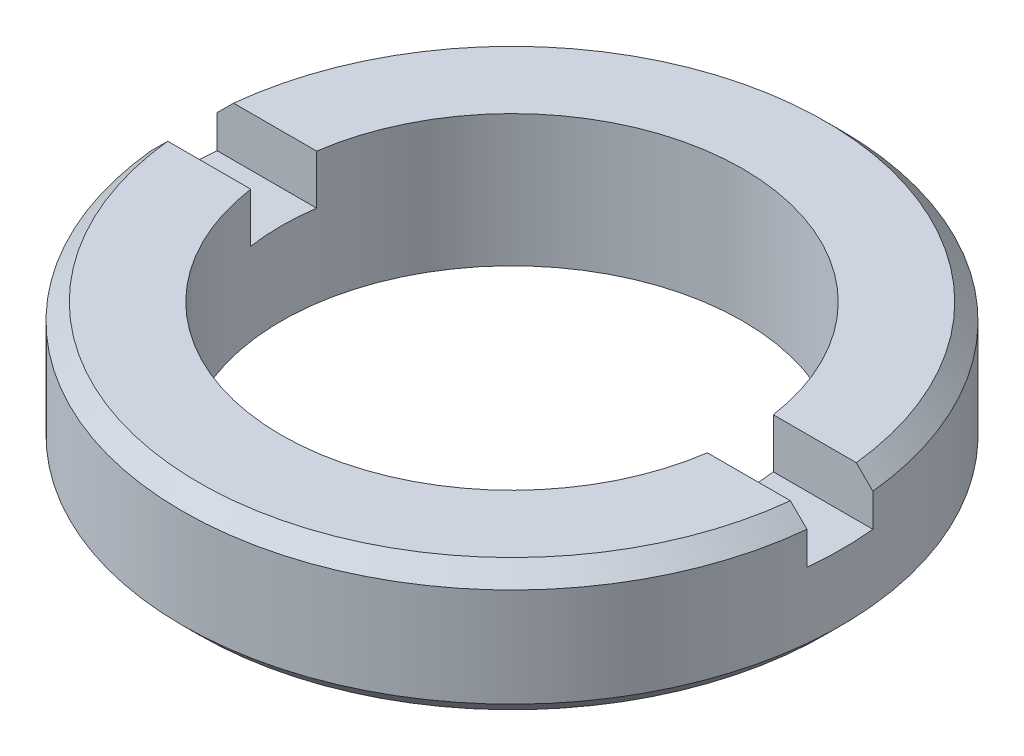
ISO-10303-21;
HEADER;
FILE_DESCRIPTION(('STEP AP214'),'2;1');
FILE_NAME('part.step','',(''),(''),'','','');
FILE_SCHEMA(('AUTOMOTIVE_DESIGN { 1 0 10303 214 1 1 1 1 }'));
ENDSEC;
DATA;
#1=APPLICATION_CONTEXT('core data for automotive mechanical design processes');
#2=APPLICATION_PROTOCOL_DEFINITION('international standard','automotive_design',2000,#1);
#3=PRODUCT_CONTEXT('',#1,'mechanical');
#4=PRODUCT('Part','Part','',(#3));
#5=PRODUCT_RELATED_PRODUCT_CATEGORY('part','',(#4));
#6=PRODUCT_DEFINITION_FORMATION('','',#4);
#7=PRODUCT_DEFINITION_CONTEXT('part definition',#1,'design');
#8=PRODUCT_DEFINITION('design','',#6,#7);
#9=PRODUCT_DEFINITION_SHAPE('','',#8);
#10=(LENGTH_UNIT() NAMED_UNIT(*) SI_UNIT(.MILLI.,.METRE.));
#11=(NAMED_UNIT(*) PLANE_ANGLE_UNIT() SI_UNIT($,.RADIAN.));
#12=(NAMED_UNIT(*) SI_UNIT($,.STERADIAN.) SOLID_ANGLE_UNIT());
#13=UNCERTAINTY_MEASURE_WITH_UNIT(LENGTH_MEASURE(1.E-05),#10,'distance_accuracy_value','');
#14=(GEOMETRIC_REPRESENTATION_CONTEXT(3) GLOBAL_UNCERTAINTY_ASSIGNED_CONTEXT((#13)) GLOBAL_UNIT_ASSIGNED_CONTEXT((#10,
#11,#12)) REPRESENTATION_CONTEXT('',''));
#15=CARTESIAN_POINT('',(0.,0.,0.));
#16=DIRECTION('',(0.,0.,1.));
#17=DIRECTION('',(1.,0.,0.));
#18=AXIS2_PLACEMENT_3D('',#15,#16,#17);
#19=CARTESIAN_POINT('',(0.,2.5,0.));
#20=DIRECTION('',(0.,1.,0.));
#21=DIRECTION('',(0.,0.,1.));
#22=AXIS2_PLACEMENT_3D('',#19,#20,#21);
#23=PLANE('',#22);
#24=DIRECTION('',(1.,0.,0.));
#25=VECTOR('',#24,1.);
#26=CARTESIAN_POINT('',(-11.32881375896,2.5,1.));
#27=LINE('',#26,#25);
#28=CARTESIAN_POINT('',(6.92820323027575,2.5,1.));
#29=VERTEX_POINT('',#28);
#30=CARTESIAN_POINT('',(9.9498743710662,2.5,1.00000000000001));
#31=VERTEX_POINT('',#30);
#32=EDGE_CURVE('E92',#29,#31,#27,.T.);
#33=ORIENTED_EDGE('',*,*,#32,.T.);
#34=CARTESIAN_POINT('',(0.,2.5,0.));
#35=DIRECTION('',(0.,1.,0.));
#36=DIRECTION('',(0.,0.,1.));
#37=AXIS2_PLACEMENT_3D('',#34,#35,#36);
#38=CIRCLE('',#37,10.);
#39=CARTESIAN_POINT('',(9.9498743710662,2.5,-1.00000000000001));
#40=VERTEX_POINT('',#39);
#41=EDGE_CURVE('E97',#31,#40,#38,.T.);
#42=ORIENTED_EDGE('',*,*,#41,.T.);
#43=DIRECTION('',(-1.,0.,0.));
#44=VECTOR('',#43,1.);
#45=CARTESIAN_POINT('',(12.43514322761,2.5,-1.));
#46=LINE('',#45,#44);
#47=CARTESIAN_POINT('',(6.92820323027575,2.5,-1.));
#48=VERTEX_POINT('',#47);
#49=EDGE_CURVE('E95',#40,#48,#46,.T.);
#50=ORIENTED_EDGE('',*,*,#49,.T.);
#51=CARTESIAN_POINT('',(0.,2.5,0.));
#52=DIRECTION('',(0.,1.,0.));
#53=DIRECTION('',(0.,0.,1.));
#54=AXIS2_PLACEMENT_3D('',#51,#52,#53);
#55=CIRCLE('',#54,7.);
#56=EDGE_CURVE('E19',#48,#29,#55,.F.);
#57=ORIENTED_EDGE('',*,*,#56,.T.);
#58=EDGE_LOOP('',(#33,#42,#50,#57));
#59=FACE_BOUND('',#58,.T.);
#60=ADVANCED_FACE('F16',(#59),#23,.T.);
#61=CARTESIAN_POINT('',(0.,2.5,0.));
#62=DIRECTION('',(0.,1.,0.));
#63=DIRECTION('',(0.,0.,1.));
#64=AXIS2_PLACEMENT_3D('',#61,#62,#63);
#65=PLANE('',#64);
#66=DIRECTION('',(-1.,0.,0.));
#67=VECTOR('',#66,1.);
#68=CARTESIAN_POINT('',(12.43514322761,2.5,-1.));
#69=LINE('',#68,#67);
#70=CARTESIAN_POINT('',(-6.92820323027576,2.5,-1.));
#71=VERTEX_POINT('',#70);
#72=CARTESIAN_POINT('',(-9.9498743710662,2.5,-1.00000000000001));
#73=VERTEX_POINT('',#72);
#74=EDGE_CURVE('E127',#71,#73,#69,.T.);
#75=ORIENTED_EDGE('',*,*,#74,.T.);
#76=CARTESIAN_POINT('',(0.,2.5,0.));
#77=DIRECTION('',(0.,1.,0.));
#78=DIRECTION('',(0.,0.,1.));
#79=AXIS2_PLACEMENT_3D('',#76,#77,#78);
#80=CIRCLE('',#79,10.);
#81=CARTESIAN_POINT('',(-9.9498743710662,2.5,1.00000000000001));
#82=VERTEX_POINT('',#81);
#83=EDGE_CURVE('E111',#73,#82,#80,.T.);
#84=ORIENTED_EDGE('',*,*,#83,.T.);
#85=DIRECTION('',(1.,0.,0.));
#86=VECTOR('',#85,1.);
#87=CARTESIAN_POINT('',(-11.32881375896,2.5,1.));
#88=LINE('',#87,#86);
#89=CARTESIAN_POINT('',(-6.92820323027575,2.5,1.));
#90=VERTEX_POINT('',#89);
#91=EDGE_CURVE('E134',#82,#90,#88,.T.);
#92=ORIENTED_EDGE('',*,*,#91,.T.);
#93=CARTESIAN_POINT('',(0.,2.5,0.));
#94=DIRECTION('',(0.,1.,0.));
#95=DIRECTION('',(0.,0.,1.));
#96=AXIS2_PLACEMENT_3D('',#93,#94,#95);
#97=CIRCLE('',#96,7.);
#98=EDGE_CURVE('E113',#90,#71,#97,.F.);
#99=ORIENTED_EDGE('',*,*,#98,.T.);
#100=EDGE_LOOP('',(#75,#84,#92,#99));
#101=FACE_BOUND('',#100,.T.);
#102=ADVANCED_FACE('F202',(#101),#65,.T.);
#103=CARTESIAN_POINT('',(0.,3.50000000000006,0.));
#104=DIRECTION('',(0.,-1.,0.));
#105=DIRECTION('',(0.,0.,-1.));
#106=AXIS2_PLACEMENT_3D('',#103,#104,#105);
#107=CONICAL_SURFACE('',#106,9.99999999999986,0.785398163397298);
#108=CARTESIAN_POINT('',(0.,3.5,0.));
#109=DIRECTION('',(0.,1.,0.));
#110=DIRECTION('',(0.,0.,1.));
#111=AXIS2_PLACEMENT_3D('',#108,#109,#110);
#112=CIRCLE('',#111,10.);
#113=CARTESIAN_POINT('',(9.94987437106615,3.50000000000001,1.00000000000001));
#114=VERTEX_POINT('',#113);
#115=CARTESIAN_POINT('',(-9.94987437106615,3.50000000000001,1.00000000000001));
#116=VERTEX_POINT('',#115);
#117=EDGE_CURVE('E142',#114,#116,#112,.F.);
#118=ORIENTED_EDGE('',*,*,#117,.F.);
#119=CARTESIAN_POINT('',(9.94987437106611,3.50000000000001,1.));
#120=CARTESIAN_POINT('',(9.86611031049698,3.58334475924358,1.));
#121=CARTESIAN_POINT('',(9.78234056711572,3.66668380552704,1.));
#122=CARTESIAN_POINT('',(9.61478971470896,3.83335047219365,1.));
#123=CARTESIAN_POINT('',(9.53100860568346,3.9166780925768,1.));
#124=CARTESIAN_POINT('',(9.44722181384583,3.99999999999984,1.));
#125=B_SPLINE_CURVE_WITH_KNOTS('',3,(#119,#120,#121,#122,#123,#124),.UNSPECIFIED.,.F.,.F.,(4,2,
4),(0.,0.354492452492855,0.708984905070248),.UNSPECIFIED.);
#126=CARTESIAN_POINT('',(9.44722181384583,3.99999999999983,1.));
#127=VERTEX_POINT('',#126);
#128=EDGE_CURVE('E105',#114,#127,#125,.T.);
#129=ORIENTED_EDGE('',*,*,#128,.T.);
#130=CARTESIAN_POINT('',(0.,3.99999999999983,0.));
#131=DIRECTION('',(0.,-1.,0.));
#132=DIRECTION('',(0.,0.,-1.));
#133=AXIS2_PLACEMENT_3D('',#130,#131,#132);
#134=CIRCLE('',#133,9.50000000000024);
#135=CARTESIAN_POINT('',(-9.44722181384583,3.99999999999983,1.));
#136=VERTEX_POINT('',#135);
#137=EDGE_CURVE('E141',#136,#127,#134,.F.);
#138=ORIENTED_EDGE('',*,*,#137,.F.);
#139=CARTESIAN_POINT('',(-9.44722181384583,3.99999999999983,1.));
#140=CARTESIAN_POINT('',(-9.53100860568346,3.91667809257679,1.));
#141=CARTESIAN_POINT('',(-9.61478971470896,3.83335047219365,1.));
#142=CARTESIAN_POINT('',(-9.78234056711572,3.66668380552704,1.));
#143=CARTESIAN_POINT('',(-9.86611031049698,3.58334475924358,1.));
#144=CARTESIAN_POINT('',(-9.94987437106611,3.50000000000002,1.));
#145=B_SPLINE_CURVE_WITH_KNOTS('',3,(#139,#140,#141,#142,#143,#144),.UNSPECIFIED.,.F.,.F.,(4,2,
4),(0.,0.354492452577391,0.708984905070241),.UNSPECIFIED.);
#146=EDGE_CURVE('E137',#136,#116,#145,.T.);
#147=ORIENTED_EDGE('',*,*,#146,.T.);
#148=EDGE_LOOP('',(#118,#129,#138,#147));
#149=FACE_BOUND('',#148,.T.);
#150=ADVANCED_FACE('F199',(#149),#107,.T.);
#151=CARTESIAN_POINT('',(-11.32881375896,4.,1.));
#152=DIRECTION('',(0.,0.,1.));
#153=DIRECTION('',(1.,0.,0.));
#154=AXIS2_PLACEMENT_3D('',#151,#152,#153);
#155=PLANE('',#154);
#156=DIRECTION('',(0.,1.,0.));
#157=VECTOR('',#156,1.);
#158=CARTESIAN_POINT('',(9.9498743710662,0.,1.00000000000002));
#159=LINE('',#158,#157);
#160=EDGE_CURVE('E104',#31,#114,#159,.T.);
#161=ORIENTED_EDGE('',*,*,#160,.F.);
#162=ORIENTED_EDGE('',*,*,#32,.F.);
#163=DIRECTION('',(0.,1.,0.));
#164=VECTOR('',#163,1.);
#165=CARTESIAN_POINT('',(6.928203230276,4.,1.));
#166=LINE('',#165,#164);
#167=CARTESIAN_POINT('',(6.92820323027575,4.,1.));
#168=VERTEX_POINT('',#167);
#169=EDGE_CURVE('E101',#168,#29,#166,.F.);
#170=ORIENTED_EDGE('',*,*,#169,.F.);
#171=DIRECTION('',(1.,0.,0.));
#172=VECTOR('',#171,1.);
#173=CARTESIAN_POINT('',(0.,4.,1.));
#174=LINE('',#173,#172);
#175=EDGE_CURVE('E157',#127,#168,#174,.F.);
#176=ORIENTED_EDGE('',*,*,#175,.F.);
#177=ORIENTED_EDGE('',*,*,#128,.F.);
#178=EDGE_LOOP('',(#161,#162,#170,#176,#177));
#179=FACE_BOUND('',#178,.T.);
#180=ADVANCED_FACE('F99',(#179),#155,.F.);
#181=CARTESIAN_POINT('',(-11.32881375896,4.,1.));
#182=DIRECTION('',(0.,0.,1.));
#183=DIRECTION('',(1.,0.,0.));
#184=AXIS2_PLACEMENT_3D('',#181,#182,#183);
#185=PLANE('',#184);
#186=ORIENTED_EDGE('',*,*,#91,.F.);
#187=DIRECTION('',(0.,1.,0.));
#188=VECTOR('',#187,1.);
#189=CARTESIAN_POINT('',(-9.9498743710662,0.,1.00000000000002));
#190=LINE('',#189,#188);
#191=EDGE_CURVE('E138',#116,#82,#190,.F.);
#192=ORIENTED_EDGE('',*,*,#191,.F.);
#193=ORIENTED_EDGE('',*,*,#146,.F.);
#194=DIRECTION('',(1.,0.,0.));
#195=VECTOR('',#194,1.);
#196=CARTESIAN_POINT('',(0.,4.,1.));
#197=LINE('',#196,#195);
#198=CARTESIAN_POINT('',(-6.92820323027575,4.,1.));
#199=VERTEX_POINT('',#198);
#200=EDGE_CURVE('E262',#199,#136,#197,.F.);
#201=ORIENTED_EDGE('',*,*,#200,.F.);
#202=DIRECTION('',(0.,1.,0.));
#203=VECTOR('',#202,1.);
#204=CARTESIAN_POINT('',(-6.928203230276,4.,1.));
#205=LINE('',#204,#203);
#206=EDGE_CURVE('E117',#90,#199,#205,.T.);
#207=ORIENTED_EDGE('',*,*,#206,.F.);
#208=EDGE_LOOP('',(#186,#192,#193,#201,#207));
#209=FACE_BOUND('',#208,.T.);
#210=ADVANCED_FACE('F183',(#209),#185,.F.);
#211=CARTESIAN_POINT('',(12.43514322761,4.,-1.));
#212=DIRECTION('',(0.,0.,-1.));
#213=DIRECTION('',(-1.,0.,0.));
#214=AXIS2_PLACEMENT_3D('',#211,#212,#213);
#215=PLANE('',#214);
#216=ORIENTED_EDGE('',*,*,#49,.F.);
#217=DIRECTION('',(0.,1.,0.));
#218=VECTOR('',#217,1.);
#219=CARTESIAN_POINT('',(9.9498743710662,0.,-1.00000000000002));
#220=LINE('',#219,#218);
#221=CARTESIAN_POINT('',(9.94987437106615,3.50000000000001,-1.00000000000001));
#222=VERTEX_POINT('',#221);
#223=EDGE_CURVE('E126',#222,#40,#220,.F.);
#224=ORIENTED_EDGE('',*,*,#223,.F.);
#225=CARTESIAN_POINT('',(9.44722181384583,3.99999999999983,-1.));
#226=CARTESIAN_POINT('',(9.53100860568346,3.91667809257679,-1.));
#227=CARTESIAN_POINT('',(9.61478971470896,3.83335047219365,-1.));
#228=CARTESIAN_POINT('',(9.78234056711572,3.66668380552704,-1.));
#229=CARTESIAN_POINT('',(9.86611031049698,3.58334475924358,-1.));
#230=CARTESIAN_POINT('',(9.94987437106611,3.50000000000002,-1.));
#231=B_SPLINE_CURVE_WITH_KNOTS('',3,(#225,#226,#227,#228,#229,#230),.UNSPECIFIED.,.F.,.F.,(4,2,
4),(0.,0.354492452577392,0.708984905070242),.UNSPECIFIED.);
#232=CARTESIAN_POINT('',(9.44722181384575,3.99999999999992,-1.));
#233=VERTEX_POINT('',#232);
#234=EDGE_CURVE('E165',#233,#222,#231,.T.);
#235=ORIENTED_EDGE('',*,*,#234,.F.);
#236=DIRECTION('',(1.,0.,0.));
#237=VECTOR('',#236,1.);
#238=CARTESIAN_POINT('',(0.,4.,-1.));
#239=LINE('',#238,#237);
#240=CARTESIAN_POINT('',(6.92820323027575,4.,-1.));
#241=VERTEX_POINT('',#240);
#242=EDGE_CURVE('E155',#241,#233,#239,.T.);
#243=ORIENTED_EDGE('',*,*,#242,.F.);
#244=DIRECTION('',(0.,1.,0.));
#245=VECTOR('',#244,1.);
#246=CARTESIAN_POINT('',(6.928203230276,4.,-1.));
#247=LINE('',#246,#245);
#248=EDGE_CURVE('E34',#48,#241,#247,.T.);
#249=ORIENTED_EDGE('',*,*,#248,.F.);
#250=EDGE_LOOP('',(#216,#224,#235,#243,#249));
#251=FACE_BOUND('',#250,.T.);
#252=ADVANCED_FACE('F177',(#251),#215,.F.);
#253=CARTESIAN_POINT('',(0.,3.50000000000006,0.));
#254=DIRECTION('',(0.,-1.,0.));
#255=DIRECTION('',(0.,0.,-1.));
#256=AXIS2_PLACEMENT_3D('',#253,#254,#255);
#257=CONICAL_SURFACE('',#256,9.99999999999986,0.7853981633973);
#258=CARTESIAN_POINT('',(0.,3.5,0.));
#259=DIRECTION('',(0.,1.,0.));
#260=DIRECTION('',(0.,0.,1.));
#261=AXIS2_PLACEMENT_3D('',#258,#259,#260);
#262=CIRCLE('',#261,10.);
#263=CARTESIAN_POINT('',(-9.94987437106616,3.50000000000001,-1.00000000000001));
#264=VERTEX_POINT('',#263);
#265=EDGE_CURVE('E122',#264,#222,#262,.F.);
#266=ORIENTED_EDGE('',*,*,#265,.F.);
#267=CARTESIAN_POINT('',(-9.94987437106611,3.50000000000001,-1.));
#268=CARTESIAN_POINT('',(-9.86611031049698,3.58334475924358,-1.));
#269=CARTESIAN_POINT('',(-9.78234056711572,3.66668380552704,-1.));
#270=CARTESIAN_POINT('',(-9.61478971470896,3.83335047219365,-1.));
#271=CARTESIAN_POINT('',(-9.53100860568346,3.91667809257679,-1.));
#272=CARTESIAN_POINT('',(-9.44722181384583,3.99999999999983,-1.));
#273=B_SPLINE_CURVE_WITH_KNOTS('',3,(#267,#268,#269,#270,#271,#272),.UNSPECIFIED.,.F.,.F.,(4,2,
4),(0.,0.354492452492852,0.708984905070245),.UNSPECIFIED.);
#274=CARTESIAN_POINT('',(-9.44722181384583,3.99999999999983,-1.));
#275=VERTEX_POINT('',#274);
#276=EDGE_CURVE('E123',#264,#275,#273,.T.);
#277=ORIENTED_EDGE('',*,*,#276,.T.);
#278=CARTESIAN_POINT('',(0.,3.99999999999983,0.));
#279=DIRECTION('',(0.,-1.,0.));
#280=DIRECTION('',(0.,0.,-1.));
#281=AXIS2_PLACEMENT_3D('',#278,#279,#280);
#282=CIRCLE('',#281,9.50000000000024);
#283=EDGE_CURVE('E152',#233,#275,#282,.F.);
#284=ORIENTED_EDGE('',*,*,#283,.F.);
#285=ORIENTED_EDGE('',*,*,#234,.T.);
#286=EDGE_LOOP('',(#266,#277,#284,#285));
#287=FACE_BOUND('',#286,.T.);
#288=ADVANCED_FACE('F174',(#287),#257,.T.);
#289=CARTESIAN_POINT('',(12.43514322761,4.,-1.));
#290=DIRECTION('',(0.,0.,-1.));
#291=DIRECTION('',(-1.,0.,0.));
#292=AXIS2_PLACEMENT_3D('',#289,#290,#291);
#293=PLANE('',#292);
#294=DIRECTION('',(0.,1.,0.));
#295=VECTOR('',#294,1.);
#296=CARTESIAN_POINT('',(-9.9498743710662,0.,-1.00000000000002));
#297=LINE('',#296,#295);
#298=EDGE_CURVE('E119',#73,#264,#297,.T.);
#299=ORIENTED_EDGE('',*,*,#298,.F.);
#300=ORIENTED_EDGE('',*,*,#74,.F.);
#301=DIRECTION('',(0.,1.,0.));
#302=VECTOR('',#301,1.);
#303=CARTESIAN_POINT('',(-6.928203230276,4.,-1.));
#304=LINE('',#303,#302);
#305=CARTESIAN_POINT('',(-6.92820323027576,4.,-1.));
#306=VERTEX_POINT('',#305);
#307=EDGE_CURVE('E130',#306,#71,#304,.F.);
#308=ORIENTED_EDGE('',*,*,#307,.F.);
#309=DIRECTION('',(1.,0.,0.));
#310=VECTOR('',#309,1.);
#311=CARTESIAN_POINT('',(0.,4.,-1.));
#312=LINE('',#311,#310);
#313=EDGE_CURVE('E154',#275,#306,#312,.T.);
#314=ORIENTED_EDGE('',*,*,#313,.F.);
#315=ORIENTED_EDGE('',*,*,#276,.F.);
#316=EDGE_LOOP('',(#299,#300,#308,#314,#315));
#317=FACE_BOUND('',#316,.T.);
#318=ADVANCED_FACE('F171',(#317),#293,.F.);
#319=CARTESIAN_POINT('',(0.,0.,0.));
#320=DIRECTION('',(0.,1.,0.));
#321=DIRECTION('',(0.,0.,1.));
#322=AXIS2_PLACEMENT_3D('',#319,#320,#321);
#323=CYLINDRICAL_SURFACE('',#322,10.);
#324=CARTESIAN_POINT('',(0.,0.499999999999938,0.));
#325=DIRECTION('',(0.,1.,0.));
#326=DIRECTION('',(0.,0.,-1.));
#327=AXIS2_PLACEMENT_3D('',#324,#325,#326);
#328=CIRCLE('',#327,10.0000000000001);
#329=CARTESIAN_POINT('',(0.,0.499999999999937,-10.0000000000001));
#330=VERTEX_POINT('',#329);
#331=EDGE_CURVE('E151',#330,#330,#328,.F.);
#332=ORIENTED_EDGE('',*,*,#331,.F.);
#333=EDGE_LOOP('',(#332));
#334=FACE_BOUND('',#333,.T.);
#335=ORIENTED_EDGE('',*,*,#191,.T.);
#336=ORIENTED_EDGE('',*,*,#83,.F.);
#337=ORIENTED_EDGE('',*,*,#298,.T.);
#338=ORIENTED_EDGE('',*,*,#265,.T.);
#339=ORIENTED_EDGE('',*,*,#223,.T.);
#340=ORIENTED_EDGE('',*,*,#41,.F.);
#341=ORIENTED_EDGE('',*,*,#160,.T.);
#342=ORIENTED_EDGE('',*,*,#117,.T.);
#343=EDGE_LOOP('',(#335,#336,#337,#338,#339,#340,#341,#342));
#344=FACE_BOUND('',#343,.T.);
#345=ADVANCED_FACE('F233',(#334,#344),#323,.T.);
#346=CARTESIAN_POINT('',(0.,4.,0.));
#347=DIRECTION('',(0.,1.,0.));
#348=DIRECTION('',(0.,0.,1.));
#349=AXIS2_PLACEMENT_3D('',#346,#347,#348);
#350=PLANE('',#349);
#351=CARTESIAN_POINT('',(0.,4.,0.));
#352=DIRECTION('',(0.,1.,0.));
#353=DIRECTION('',(0.,0.,1.));
#354=AXIS2_PLACEMENT_3D('',#351,#352,#353);
#355=CIRCLE('',#354,7.);
#356=EDGE_CURVE('E110',#168,#199,#355,.F.);
#357=ORIENTED_EDGE('',*,*,#356,.T.);
#358=ORIENTED_EDGE('',*,*,#200,.T.);
#359=ORIENTED_EDGE('',*,*,#137,.T.);
#360=ORIENTED_EDGE('',*,*,#175,.T.);
#361=EDGE_LOOP('',(#357,#358,#359,#360));
#362=FACE_BOUND('',#361,.T.);
#363=ADVANCED_FACE('F230',(#362),#350,.T.);
#364=CARTESIAN_POINT('',(0.,4.,0.));
#365=DIRECTION('',(0.,1.,0.));
#366=DIRECTION('',(0.,0.,1.));
#367=AXIS2_PLACEMENT_3D('',#364,#365,#366);
#368=PLANE('',#367);
#369=ORIENTED_EDGE('',*,*,#283,.T.);
#370=ORIENTED_EDGE('',*,*,#313,.T.);
#371=CARTESIAN_POINT('',(0.,4.,0.));
#372=DIRECTION('',(0.,1.,0.));
#373=DIRECTION('',(0.,0.,1.));
#374=AXIS2_PLACEMENT_3D('',#371,#372,#373);
#375=CIRCLE('',#374,7.);
#376=EDGE_CURVE('E147',#306,#241,#375,.F.);
#377=ORIENTED_EDGE('',*,*,#376,.T.);
#378=ORIENTED_EDGE('',*,*,#242,.T.);
#379=EDGE_LOOP('',(#369,#370,#377,#378));
#380=FACE_BOUND('',#379,.T.);
#381=ADVANCED_FACE('F226',(#380),#368,.T.);
#382=CARTESIAN_POINT('',(0.,0.499999999999938,0.));
#383=DIRECTION('',(0.,1.,0.));
#384=DIRECTION('',(0.,0.,1.));
#385=AXIS2_PLACEMENT_3D('',#382,#383,#384);
#386=CONICAL_SURFACE('',#385,10.0000000000001,0.785398163397298);
#387=ORIENTED_EDGE('',*,*,#331,.T.);
#388=EDGE_LOOP('',(#387));
#389=FACE_BOUND('',#388,.T.);
#390=CARTESIAN_POINT('',(0.,-1.37043154602168E-13,0.));
#391=DIRECTION('',(0.,1.,0.));
#392=DIRECTION('',(0.,0.,1.));
#393=AXIS2_PLACEMENT_3D('',#390,#391,#392);
#394=CIRCLE('',#393,9.50000000000014);
#395=CARTESIAN_POINT('',(0.,-1.37043154602168E-13,9.50000000000014));
#396=VERTEX_POINT('',#395);
#397=EDGE_CURVE('E25',#396,#396,#394,.T.);
#398=ORIENTED_EDGE('',*,*,#397,.T.);
#399=EDGE_LOOP('',(#398));
#400=FACE_BOUND('',#399,.T.);
#401=ADVANCED_FACE('F218',(#389,#400),#386,.T.);
#402=CARTESIAN_POINT('',(0.,0.,0.));
#403=DIRECTION('',(0.,1.,0.));
#404=DIRECTION('',(0.,0.,1.));
#405=AXIS2_PLACEMENT_3D('',#402,#403,#404);
#406=CYLINDRICAL_SURFACE('',#405,7.);
#407=CARTESIAN_POINT('',(0.,0.,0.));
#408=DIRECTION('',(0.,1.,0.));
#409=DIRECTION('',(0.,0.,1.));
#410=AXIS2_PLACEMENT_3D('',#407,#408,#409);
#411=CIRCLE('',#410,7.);
#412=CARTESIAN_POINT('',(0.,0.,7.));
#413=VERTEX_POINT('',#412);
#414=EDGE_CURVE('E11',#413,#413,#411,.F.);
#415=ORIENTED_EDGE('',*,*,#414,.T.);
#416=EDGE_LOOP('',(#415));
#417=FACE_BOUND('',#416,.T.);
#418=ORIENTED_EDGE('',*,*,#376,.F.);
#419=ORIENTED_EDGE('',*,*,#307,.T.);
#420=ORIENTED_EDGE('',*,*,#98,.F.);
#421=ORIENTED_EDGE('',*,*,#206,.T.);
#422=ORIENTED_EDGE('',*,*,#356,.F.);
#423=ORIENTED_EDGE('',*,*,#169,.T.);
#424=ORIENTED_EDGE('',*,*,#56,.F.);
#425=ORIENTED_EDGE('',*,*,#248,.T.);
#426=EDGE_LOOP('',(#418,#419,#420,#421,#422,#423,#424,#425));
#427=FACE_BOUND('',#426,.T.);
#428=ADVANCED_FACE('F108',(#417,#427),#406,.F.);
#429=CARTESIAN_POINT('',(0.,0.,0.));
#430=DIRECTION('',(0.,1.,0.));
#431=DIRECTION('',(0.,0.,1.));
#432=AXIS2_PLACEMENT_3D('',#429,#430,#431);
#433=PLANE('',#432);
#434=ORIENTED_EDGE('',*,*,#414,.F.);
#435=EDGE_LOOP('',(#434));
#436=FACE_BOUND('',#435,.T.);
#437=ORIENTED_EDGE('',*,*,#397,.F.);
#438=EDGE_LOOP('',(#437));
#439=FACE_BOUND('',#438,.T.);
#440=ADVANCED_FACE('F211',(#436,#439),#433,.F.);
#441=CLOSED_SHELL('',(#60,#102,#150,#180,#210,#252,#288,#318,#345,#363,#381,#401,#428,#440));
#442=MANIFOLD_SOLID_BREP('B1',#441);
#443=ADVANCED_BREP_SHAPE_REPRESENTATION('',(#18,#442),#14);
#444=SHAPE_DEFINITION_REPRESENTATION(#9,#443);
ENDSEC;
END-ISO-10303-21;
